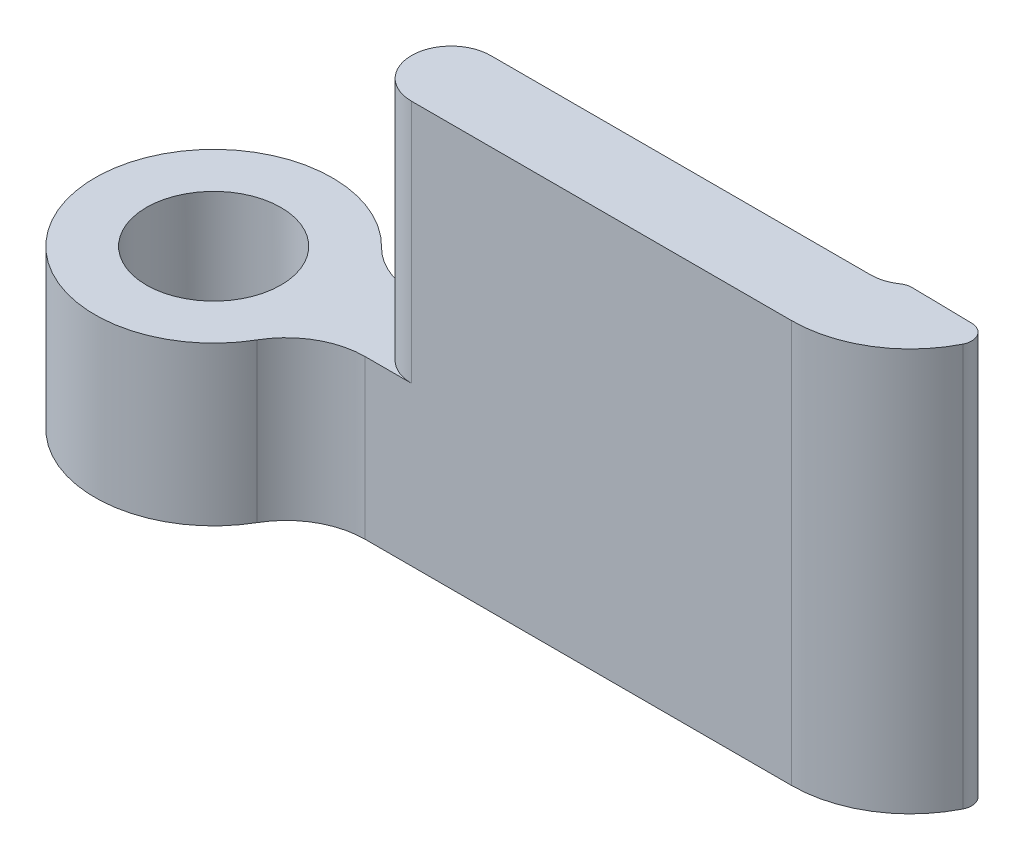
ISO-10303-21;
HEADER;
FILE_DESCRIPTION(('STEP AP214'),'2;1');
FILE_NAME('part.step','',(''),(''),'','','');
FILE_SCHEMA(('AUTOMOTIVE_DESIGN { 1 0 10303 214 1 1 1 1 }'));
ENDSEC;
DATA;
#1=APPLICATION_CONTEXT('core data for automotive mechanical design processes');
#2=APPLICATION_PROTOCOL_DEFINITION('international standard','automotive_design',2000,#1);
#3=PRODUCT_CONTEXT('',#1,'mechanical');
#4=PRODUCT('Part','Part','',(#3));
#5=PRODUCT_RELATED_PRODUCT_CATEGORY('part','',(#4));
#6=PRODUCT_DEFINITION_FORMATION('','',#4);
#7=PRODUCT_DEFINITION_CONTEXT('part definition',#1,'design');
#8=PRODUCT_DEFINITION('design','',#6,#7);
#9=PRODUCT_DEFINITION_SHAPE('','',#8);
#10=(LENGTH_UNIT() NAMED_UNIT(*) SI_UNIT(.MILLI.,.METRE.));
#11=(NAMED_UNIT(*) PLANE_ANGLE_UNIT() SI_UNIT($,.RADIAN.));
#12=(NAMED_UNIT(*) SI_UNIT($,.STERADIAN.) SOLID_ANGLE_UNIT());
#13=UNCERTAINTY_MEASURE_WITH_UNIT(LENGTH_MEASURE(1.E-05),#10,'distance_accuracy_value','');
#14=(GEOMETRIC_REPRESENTATION_CONTEXT(3) GLOBAL_UNCERTAINTY_ASSIGNED_CONTEXT((#13)) GLOBAL_UNIT_ASSIGNED_CONTEXT((#10,
#11,#12)) REPRESENTATION_CONTEXT('',''));
#15=CARTESIAN_POINT('',(0.,0.,0.));
#16=DIRECTION('',(0.,0.,1.));
#17=DIRECTION('',(1.,0.,0.));
#18=AXIS2_PLACEMENT_3D('',#15,#16,#17);
#19=CARTESIAN_POINT('',(19.1841197027665,20.63,-3.175));
#20=DIRECTION('',(0.,-1.,0.));
#21=DIRECTION('',(0.,0.,1.));
#22=AXIS2_PLACEMENT_3D('',#19,#20,#21);
#23=CYLINDRICAL_SURFACE('',#22,3.81);
#24=CARTESIAN_POINT('',(19.1841197027665,3.856199918,-3.175));
#25=DIRECTION('',(0.,1.,0.));
#26=DIRECTION('',(0.,0.,1.));
#27=AXIS2_PLACEMENT_3D('',#24,#25,#26);
#28=CIRCLE('',#27,3.81);
#29=CARTESIAN_POINT('',(19.1841197027665,3.856199918,0.635));
#30=VERTEX_POINT('',#29);
#31=CARTESIAN_POINT('',(22.5865531446849,3.856199918,-1.46048937789378));
#32=VERTEX_POINT('',#31);
#33=EDGE_CURVE('E162',#30,#32,#28,.T.);
#34=ORIENTED_EDGE('',*,*,#33,.T.);
#35=DIRECTION('',(0.,-1.,0.));
#36=VECTOR('',#35,1.);
#37=CARTESIAN_POINT('',(22.5865531446849,20.63,-1.46048937789378));
#38=LINE('',#37,#36);
#39=CARTESIAN_POINT('',(22.5865531446849,16.7786,-1.46048937789378));
#40=VERTEX_POINT('',#39);
#41=EDGE_CURVE('E215',#40,#32,#38,.T.);
#42=ORIENTED_EDGE('',*,*,#41,.F.);
#43=CARTESIAN_POINT('',(19.1841197027665,16.7786,-3.175));
#44=DIRECTION('',(0.,-1.,0.));
#45=DIRECTION('',(0.,0.,-1.));
#46=AXIS2_PLACEMENT_3D('',#43,#44,#45);
#47=CIRCLE('',#46,3.81);
#48=CARTESIAN_POINT('',(19.1841197027665,16.7786,0.635));
#49=VERTEX_POINT('',#48);
#50=EDGE_CURVE('E188',#40,#49,#47,.T.);
#51=ORIENTED_EDGE('',*,*,#50,.T.);
#52=DIRECTION('',(0.,-1.,0.));
#53=VECTOR('',#52,1.);
#54=CARTESIAN_POINT('',(19.1841197027665,20.63,0.635));
#55=LINE('',#54,#53);
#56=EDGE_CURVE('E212',#49,#30,#55,.T.);
#57=ORIENTED_EDGE('',*,*,#56,.T.);
#58=EDGE_LOOP('',(#34,#42,#51,#57));
#59=FACE_BOUND('',#58,.T.);
#60=ADVANCED_FACE('F34',(#59),#23,.T.);
#61=CARTESIAN_POINT('',(5.49926131403118,20.63,0.635));
#62=DIRECTION('',(0.,0.,-1.));
#63=DIRECTION('',(1.,0.,0.));
#64=AXIS2_PLACEMENT_3D('',#61,#62,#63);
#65=PLANE('',#64);
#66=DIRECTION('',(-1.,0.,0.));
#67=VECTOR('',#66,1.);
#68=CARTESIAN_POINT('',(5.49926131403118,8.936199918,0.635));
#69=LINE('',#68,#67);
#70=CARTESIAN_POINT('',(6.985,8.936199918,0.635));
#71=VERTEX_POINT('',#70);
#72=CARTESIAN_POINT('',(5.49926131403118,8.936199918,0.635000000000001));
#73=VERTEX_POINT('',#72);
#74=EDGE_CURVE('E201',#71,#73,#69,.T.);
#75=ORIENTED_EDGE('',*,*,#74,.T.);
#76=DIRECTION('',(0.,-1.,0.));
#77=VECTOR('',#76,1.);
#78=CARTESIAN_POINT('',(5.49926131403118,20.63,0.635));
#79=LINE('',#78,#77);
#80=CARTESIAN_POINT('',(5.49926131403118,3.856199918,0.635000000000001));
#81=VERTEX_POINT('',#80);
#82=EDGE_CURVE('E209',#73,#81,#79,.T.);
#83=ORIENTED_EDGE('',*,*,#82,.T.);
#84=DIRECTION('',(1.,0.,0.));
#85=VECTOR('',#84,1.);
#86=CARTESIAN_POINT('',(5.49926131403118,3.856199918,0.635));
#87=LINE('',#86,#85);
#88=EDGE_CURVE('E160',#81,#30,#87,.T.);
#89=ORIENTED_EDGE('',*,*,#88,.T.);
#90=ORIENTED_EDGE('',*,*,#56,.F.);
#91=DIRECTION('',(-1.,0.,0.));
#92=VECTOR('',#91,1.);
#93=CARTESIAN_POINT('',(5.49926131403118,16.7786,0.635));
#94=LINE('',#93,#92);
#95=CARTESIAN_POINT('',(6.985,16.7786,0.635));
#96=VERTEX_POINT('',#95);
#97=EDGE_CURVE('E185',#49,#96,#94,.T.);
#98=ORIENTED_EDGE('',*,*,#97,.T.);
#99=DIRECTION('',(0.,1.,0.));
#100=VECTOR('',#99,1.);
#101=CARTESIAN_POINT('',(6.985,20.63,0.635));
#102=LINE('',#101,#100);
#103=EDGE_CURVE('E231',#71,#96,#102,.T.);
#104=ORIENTED_EDGE('',*,*,#103,.F.);
#105=EDGE_LOOP('',(#75,#83,#89,#90,#98,#104));
#106=FACE_BOUND('',#105,.T.);
#107=ADVANCED_FACE('F246',(#106),#65,.F.);
#108=CARTESIAN_POINT('',(19.1841197027665,20.63,-1.905));
#109=DIRECTION('',(0.,0.,1.));
#110=DIRECTION('',(-1.,0.,0.));
#111=AXIS2_PLACEMENT_3D('',#108,#109,#110);
#112=PLANE('',#111);
#113=DIRECTION('',(1.,0.,0.));
#114=VECTOR('',#113,1.);
#115=CARTESIAN_POINT('',(19.1841197027665,16.7786,-1.905));
#116=LINE('',#115,#114);
#117=CARTESIAN_POINT('',(6.985,16.7786,-1.905));
#118=VERTEX_POINT('',#117);
#119=CARTESIAN_POINT('',(19.1841197027665,16.7786,-1.905));
#120=VERTEX_POINT('',#119);
#121=EDGE_CURVE('E180',#118,#120,#116,.T.);
#122=ORIENTED_EDGE('',*,*,#121,.T.);
#123=DIRECTION('',(0.,-1.,0.));
#124=VECTOR('',#123,1.);
#125=CARTESIAN_POINT('',(19.1841197027665,20.63,-1.905));
#126=LINE('',#125,#124);
#127=CARTESIAN_POINT('',(19.1841197027665,3.856199918,-1.905));
#128=VERTEX_POINT('',#127);
#129=EDGE_CURVE('E204',#120,#128,#126,.T.);
#130=ORIENTED_EDGE('',*,*,#129,.T.);
#131=DIRECTION('',(-1.,0.,0.));
#132=VECTOR('',#131,1.);
#133=CARTESIAN_POINT('',(19.1841197027665,3.856199918,-1.905));
#134=LINE('',#133,#132);
#135=CARTESIAN_POINT('',(4.53480705212471,3.856199918,-1.905));
#136=VERTEX_POINT('',#135);
#137=EDGE_CURVE('E156',#128,#136,#134,.T.);
#138=ORIENTED_EDGE('',*,*,#137,.T.);
#139=DIRECTION('',(0.,-1.,0.));
#140=VECTOR('',#139,1.);
#141=CARTESIAN_POINT('',(4.53480705212471,20.63,-1.905));
#142=LINE('',#141,#140);
#143=CARTESIAN_POINT('',(4.53480705212471,8.936199918,-1.905));
#144=VERTEX_POINT('',#143);
#145=EDGE_CURVE('E134',#144,#136,#142,.T.);
#146=ORIENTED_EDGE('',*,*,#145,.F.);
#147=DIRECTION('',(1.,0.,0.));
#148=VECTOR('',#147,1.);
#149=CARTESIAN_POINT('',(19.1841197027665,8.936199918,-1.905));
#150=LINE('',#149,#148);
#151=CARTESIAN_POINT('',(6.985,8.936199918,-1.905));
#152=VERTEX_POINT('',#151);
#153=EDGE_CURVE('E192',#144,#152,#150,.T.);
#154=ORIENTED_EDGE('',*,*,#153,.T.);
#155=DIRECTION('',(0.,-1.,0.));
#156=VECTOR('',#155,1.);
#157=CARTESIAN_POINT('',(6.985,20.63,-1.905));
#158=LINE('',#157,#156);
#159=EDGE_CURVE('E240',#118,#152,#158,.T.);
#160=ORIENTED_EDGE('',*,*,#159,.F.);
#161=EDGE_LOOP('',(#122,#130,#138,#146,#154,#160));
#162=FACE_BOUND('',#161,.T.);
#163=ADVANCED_FACE('F268',(#162),#112,.F.);
#164=CARTESIAN_POINT('',(19.1841197027665,20.63,-3.175));
#165=DIRECTION('',(0.,-1.,0.));
#166=DIRECTION('',(0.,0.,1.));
#167=AXIS2_PLACEMENT_3D('',#164,#165,#166);
#168=CYLINDRICAL_SURFACE('',#167,1.27);
#169=CARTESIAN_POINT('',(19.1841197027665,3.856199918,-3.175));
#170=DIRECTION('',(0.,1.,0.));
#171=DIRECTION('',(0.,0.,1.));
#172=AXIS2_PLACEMENT_3D('',#169,#170,#171);
#173=CIRCLE('',#172,1.27);
#174=CARTESIAN_POINT('',(19.9067946493673,3.856199918,-2.13066244846051));
#175=VERTEX_POINT('',#174);
#176=EDGE_CURVE('E170',#175,#128,#173,.F.);
#177=ORIENTED_EDGE('',*,*,#176,.T.);
#178=ORIENTED_EDGE('',*,*,#129,.F.);
#179=CARTESIAN_POINT('',(19.1841197027665,16.7786,-3.175));
#180=DIRECTION('',(0.,-1.,0.));
#181=DIRECTION('',(0.,0.,-1.));
#182=AXIS2_PLACEMENT_3D('',#179,#180,#181);
#183=CIRCLE('',#182,1.27);
#184=CARTESIAN_POINT('',(19.9067946493673,16.7786,-2.13066244846051));
#185=VERTEX_POINT('',#184);
#186=EDGE_CURVE('E177',#120,#185,#183,.F.);
#187=ORIENTED_EDGE('',*,*,#186,.T.);
#188=DIRECTION('',(0.,-1.,0.));
#189=VECTOR('',#188,1.);
#190=CARTESIAN_POINT('',(19.9067946493673,20.63,-2.13066244846051));
#191=LINE('',#190,#189);
#192=EDGE_CURVE('E226',#175,#185,#191,.F.);
#193=ORIENTED_EDGE('',*,*,#192,.F.);
#194=EDGE_LOOP('',(#177,#178,#187,#193));
#195=FACE_BOUND('',#194,.T.);
#196=ADVANCED_FACE('F272',(#195),#168,.F.);
#197=CARTESIAN_POINT('',(22.86,20.63,-2.17299997983507));
#198=DIRECTION('',(-0.0174524064372835,0.,0.999847695156391));
#199=DIRECTION('',(-0.999847695156391,0.,-0.0174524064372835));
#200=AXIS2_PLACEMENT_3D('',#197,#198,#199);
#201=PLANE('',#200);
#202=DIRECTION('',(-0.999847695156391,0.,-0.0174524064372835));
#203=VECTOR('',#202,1.);
#204=CARTESIAN_POINT('',(22.86,3.856199918,-2.17299997983507));
#205=LINE('',#204,#203);
#206=CARTESIAN_POINT('',(22.1487657728487,3.856199918,-2.18541461944917));
#207=VERTEX_POINT('',#206);
#208=CARTESIAN_POINT('',(20.2000385480981,3.856199918,-2.21942977968457));
#209=VERTEX_POINT('',#208);
#210=EDGE_CURVE('E167',#207,#209,#205,.T.);
#211=ORIENTED_EDGE('',*,*,#210,.T.);
#212=DIRECTION('',(0.,-1.,0.));
#213=VECTOR('',#212,1.);
#214=CARTESIAN_POINT('',(20.2000385480981,20.63,-2.21942977968457));
#215=LINE('',#214,#213);
#216=CARTESIAN_POINT('',(20.2000385480981,16.7786,-2.21942977968457));
#217=VERTEX_POINT('',#216);
#218=EDGE_CURVE('E220',#217,#209,#215,.T.);
#219=ORIENTED_EDGE('',*,*,#218,.F.);
#220=DIRECTION('',(0.999847695156391,0.,0.0174524064372835));
#221=VECTOR('',#220,1.);
#222=CARTESIAN_POINT('',(22.86,16.7786,-2.17299997983507));
#223=LINE('',#222,#221);
#224=CARTESIAN_POINT('',(22.1487657728487,16.7786,-2.18541461944917));
#225=VERTEX_POINT('',#224);
#226=EDGE_CURVE('E174',#217,#225,#223,.T.);
#227=ORIENTED_EDGE('',*,*,#226,.T.);
#228=DIRECTION('',(0.,-1.,0.));
#229=VECTOR('',#228,1.);
#230=CARTESIAN_POINT('',(22.1487657728487,20.63,-2.18541461944917));
#231=LINE('',#230,#229);
#232=EDGE_CURVE('E223',#207,#225,#231,.F.);
#233=ORIENTED_EDGE('',*,*,#232,.F.);
#234=EDGE_LOOP('',(#211,#219,#227,#233));
#235=FACE_BOUND('',#234,.T.);
#236=ADVANCED_FACE('F277',(#235),#201,.F.);
#237=CARTESIAN_POINT('',(22.14003956963,20.63,-1.68549077187097));
#238=DIRECTION('',(0.,-1.,0.));
#239=DIRECTION('',(0.,0.,1.));
#240=AXIS2_PLACEMENT_3D('',#237,#238,#239);
#241=CYLINDRICAL_SURFACE('',#240,0.5);
#242=ORIENTED_EDGE('',*,*,#232,.T.);
#243=CARTESIAN_POINT('',(22.14003956963,16.7786,-1.68549077187097));
#244=DIRECTION('',(0.,-1.,0.));
#245=DIRECTION('',(0.,0.,-1.));
#246=AXIS2_PLACEMENT_3D('',#243,#244,#245);
#247=CIRCLE('',#246,0.5);
#248=EDGE_CURVE('E183',#40,#225,#247,.F.);
#249=ORIENTED_EDGE('',*,*,#248,.F.);
#250=ORIENTED_EDGE('',*,*,#41,.T.);
#251=CARTESIAN_POINT('',(22.14003956963,3.856199918,-1.68549077187097));
#252=DIRECTION('',(0.,1.,0.));
#253=DIRECTION('',(0.,0.,1.));
#254=AXIS2_PLACEMENT_3D('',#251,#252,#253);
#255=CIRCLE('',#254,0.5);
#256=EDGE_CURVE('E165',#207,#32,#255,.F.);
#257=ORIENTED_EDGE('',*,*,#256,.F.);
#258=EDGE_LOOP('',(#242,#249,#250,#257));
#259=FACE_BOUND('',#258,.T.);
#260=ADVANCED_FACE('F259',(#259),#241,.T.);
#261=CARTESIAN_POINT('',(20.1913123448794,20.63,-1.71950593210638));
#262=DIRECTION('',(0.,-1.,0.));
#263=DIRECTION('',(0.,0.,1.));
#264=AXIS2_PLACEMENT_3D('',#261,#262,#263);
#265=CYLINDRICAL_SURFACE('',#264,0.5);
#266=ORIENTED_EDGE('',*,*,#192,.T.);
#267=CARTESIAN_POINT('',(20.1913123448794,16.7786,-1.71950593210638));
#268=DIRECTION('',(0.,-1.,0.));
#269=DIRECTION('',(0.,0.,-1.));
#270=AXIS2_PLACEMENT_3D('',#267,#268,#269);
#271=CIRCLE('',#270,0.5);
#272=EDGE_CURVE('E229',#217,#185,#271,.F.);
#273=ORIENTED_EDGE('',*,*,#272,.F.);
#274=ORIENTED_EDGE('',*,*,#218,.T.);
#275=CARTESIAN_POINT('',(20.1913123448794,3.856199918,-1.71950593210638));
#276=DIRECTION('',(0.,1.,0.));
#277=DIRECTION('',(0.,0.,1.));
#278=AXIS2_PLACEMENT_3D('',#275,#276,#277);
#279=CIRCLE('',#278,0.5);
#280=EDGE_CURVE('E172',#175,#209,#279,.F.);
#281=ORIENTED_EDGE('',*,*,#280,.F.);
#282=EDGE_LOOP('',(#266,#273,#274,#281));
#283=FACE_BOUND('',#282,.T.);
#284=ADVANCED_FACE('F274',(#283),#265,.T.);
#285=CARTESIAN_POINT('',(5.49926131403118,20.63,3.175));
#286=DIRECTION('',(0.,-1.,0.));
#287=DIRECTION('',(0.,0.,1.));
#288=AXIS2_PLACEMENT_3D('',#285,#286,#287);
#289=CYLINDRICAL_SURFACE('',#288,2.54);
#290=CARTESIAN_POINT('',(5.49926131403118,3.856199918,3.175));
#291=DIRECTION('',(0.,1.,0.));
#292=DIRECTION('',(0.,0.,1.));
#293=AXIS2_PLACEMENT_3D('',#290,#291,#292);
#294=CIRCLE('',#293,2.54);
#295=CARTESIAN_POINT('',(3.29955678841871,3.856199918,1.905));
#296=VERTEX_POINT('',#295);
#297=EDGE_CURVE('E154',#296,#81,#294,.F.);
#298=ORIENTED_EDGE('',*,*,#297,.T.);
#299=ORIENTED_EDGE('',*,*,#82,.F.);
#300=CARTESIAN_POINT('',(5.49926131403118,8.936199918,3.175));
#301=DIRECTION('',(0.,-1.,0.));
#302=DIRECTION('',(0.,0.,-1.));
#303=AXIS2_PLACEMENT_3D('',#300,#301,#302);
#304=CIRCLE('',#303,2.54);
#305=CARTESIAN_POINT('',(3.29955678841871,8.936199918,1.905));
#306=VERTEX_POINT('',#305);
#307=EDGE_CURVE('E198',#73,#306,#304,.F.);
#308=ORIENTED_EDGE('',*,*,#307,.T.);
#309=DIRECTION('',(0.,-1.,0.));
#310=VECTOR('',#309,1.);
#311=CARTESIAN_POINT('',(3.29955678841871,20.63,1.905));
#312=LINE('',#311,#310);
#313=EDGE_CURVE('E147',#306,#296,#312,.T.);
#314=ORIENTED_EDGE('',*,*,#313,.T.);
#315=EDGE_LOOP('',(#298,#299,#308,#314));
#316=FACE_BOUND('',#315,.T.);
#317=ADVANCED_FACE('F251',(#316),#289,.F.);
#318=CARTESIAN_POINT('',(0.,20.63,0.));
#319=DIRECTION('',(0.,-1.,0.));
#320=DIRECTION('',(0.,0.,1.));
#321=AXIS2_PLACEMENT_3D('',#318,#319,#320);
#322=CYLINDRICAL_SURFACE('',#321,3.80999999999999);
#323=CARTESIAN_POINT('',(0.,3.856199918,0.));
#324=DIRECTION('',(0.,1.,0.));
#325=DIRECTION('',(0.,0.,1.));
#326=AXIS2_PLACEMENT_3D('',#323,#324,#325);
#327=CIRCLE('',#326,3.80999999999999);
#328=CARTESIAN_POINT('',(2.72088423127483,3.856199918,-2.667));
#329=VERTEX_POINT('',#328);
#330=EDGE_CURVE('E139',#329,#296,#327,.T.);
#331=ORIENTED_EDGE('',*,*,#330,.T.);
#332=ORIENTED_EDGE('',*,*,#313,.F.);
#333=CARTESIAN_POINT('',(0.,8.936199918,0.));
#334=DIRECTION('',(0.,-1.,0.));
#335=DIRECTION('',(0.,0.,-1.));
#336=AXIS2_PLACEMENT_3D('',#333,#334,#335);
#337=CIRCLE('',#336,3.80999999999999);
#338=CARTESIAN_POINT('',(2.72088423127483,8.936199918,-2.667));
#339=VERTEX_POINT('',#338);
#340=EDGE_CURVE('E146',#306,#339,#337,.T.);
#341=ORIENTED_EDGE('',*,*,#340,.T.);
#342=DIRECTION('',(0.,-1.,0.));
#343=VECTOR('',#342,1.);
#344=CARTESIAN_POINT('',(2.72088423127483,20.63,-2.667));
#345=LINE('',#344,#343);
#346=EDGE_CURVE('E131',#339,#329,#345,.T.);
#347=ORIENTED_EDGE('',*,*,#346,.T.);
#348=EDGE_LOOP('',(#331,#332,#341,#347));
#349=FACE_BOUND('',#348,.T.);
#350=ADVANCED_FACE('F143',(#349),#322,.T.);
#351=CARTESIAN_POINT('',(4.53480705212471,20.63,-4.445));
#352=DIRECTION('',(0.,-1.,0.));
#353=DIRECTION('',(0.,0.,1.));
#354=AXIS2_PLACEMENT_3D('',#351,#352,#353);
#355=CYLINDRICAL_SURFACE('',#354,2.54);
#356=CARTESIAN_POINT('',(4.53480705212471,3.856199918,-4.445));
#357=DIRECTION('',(0.,1.,0.));
#358=DIRECTION('',(0.,0.,1.));
#359=AXIS2_PLACEMENT_3D('',#356,#357,#358);
#360=CIRCLE('',#359,2.54);
#361=EDGE_CURVE('E128',#136,#329,#360,.F.);
#362=ORIENTED_EDGE('',*,*,#361,.T.);
#363=ORIENTED_EDGE('',*,*,#346,.F.);
#364=CARTESIAN_POINT('',(4.53480705212471,8.936199918,-4.445));
#365=DIRECTION('',(0.,-1.,0.));
#366=DIRECTION('',(0.,0.,-1.));
#367=AXIS2_PLACEMENT_3D('',#364,#365,#366);
#368=CIRCLE('',#367,2.54);
#369=EDGE_CURVE('E195',#339,#144,#368,.F.);
#370=ORIENTED_EDGE('',*,*,#369,.T.);
#371=ORIENTED_EDGE('',*,*,#145,.T.);
#372=EDGE_LOOP('',(#362,#363,#370,#371));
#373=FACE_BOUND('',#372,.T.);
#374=ADVANCED_FACE('F130',(#373),#355,.F.);
#375=CARTESIAN_POINT('',(0.,20.63,0.));
#376=DIRECTION('',(0.,-1.,0.));
#377=DIRECTION('',(0.,0.,1.));
#378=AXIS2_PLACEMENT_3D('',#375,#376,#377);
#379=CYLINDRICAL_SURFACE('',#378,2.159);
#380=CARTESIAN_POINT('',(0.,8.936199918,0.));
#381=DIRECTION('',(0.,-1.,0.));
#382=DIRECTION('',(0.,0.,-1.));
#383=AXIS2_PLACEMENT_3D('',#380,#381,#382);
#384=CIRCLE('',#383,2.159);
#385=CARTESIAN_POINT('',(0.,8.936199918,-2.15900000000001));
#386=VERTEX_POINT('',#385);
#387=EDGE_CURVE('E191',#386,#386,#384,.T.);
#388=ORIENTED_EDGE('',*,*,#387,.F.);
#389=EDGE_LOOP('',(#388));
#390=FACE_BOUND('',#389,.T.);
#391=CARTESIAN_POINT('',(0.,3.856199918,0.));
#392=DIRECTION('',(0.,1.,0.));
#393=DIRECTION('',(0.,0.,1.));
#394=AXIS2_PLACEMENT_3D('',#391,#392,#393);
#395=CIRCLE('',#394,2.159);
#396=CARTESIAN_POINT('',(0.,3.856199918,2.15899999999999));
#397=VERTEX_POINT('',#396);
#398=EDGE_CURVE('E140',#397,#397,#395,.T.);
#399=ORIENTED_EDGE('',*,*,#398,.F.);
#400=EDGE_LOOP('',(#399));
#401=FACE_BOUND('',#400,.T.);
#402=ADVANCED_FACE('F310',(#390,#401),#379,.F.);
#403=CARTESIAN_POINT('',(0.,8.936199918,0.));
#404=DIRECTION('',(0.,1.,0.));
#405=DIRECTION('',(0.,0.,-1.));
#406=AXIS2_PLACEMENT_3D('',#403,#404,#405);
#407=PLANE('',#406);
#408=ORIENTED_EDGE('',*,*,#387,.T.);
#409=EDGE_LOOP('',(#408));
#410=FACE_BOUND('',#409,.T.);
#411=ORIENTED_EDGE('',*,*,#74,.F.);
#412=CARTESIAN_POINT('',(6.985,8.936199918,-0.635));
#413=DIRECTION('',(0.,-1.,0.));
#414=DIRECTION('',(0.,0.,-1.));
#415=AXIS2_PLACEMENT_3D('',#412,#413,#414);
#416=CIRCLE('',#415,1.27);
#417=CARTESIAN_POINT('',(5.715,8.936199918,-0.635));
#418=VERTEX_POINT('',#417);
#419=EDGE_CURVE('E43',#418,#71,#416,.F.);
#420=ORIENTED_EDGE('',*,*,#419,.F.);
#421=CARTESIAN_POINT('',(6.985,8.936199918,-0.635));
#422=DIRECTION('',(0.,-1.,0.));
#423=DIRECTION('',(0.,0.,-1.));
#424=AXIS2_PLACEMENT_3D('',#421,#422,#423);
#425=CIRCLE('',#424,1.27);
#426=EDGE_CURVE('E12',#152,#418,#425,.F.);
#427=ORIENTED_EDGE('',*,*,#426,.F.);
#428=ORIENTED_EDGE('',*,*,#153,.F.);
#429=ORIENTED_EDGE('',*,*,#369,.F.);
#430=ORIENTED_EDGE('',*,*,#340,.F.);
#431=ORIENTED_EDGE('',*,*,#307,.F.);
#432=EDGE_LOOP('',(#411,#420,#427,#428,#429,#430,#431));
#433=FACE_BOUND('',#432,.T.);
#434=ADVANCED_FACE('F248',(#410,#433),#407,.T.);
#435=CARTESIAN_POINT('',(0.,16.7786,0.));
#436=DIRECTION('',(0.,1.,0.));
#437=DIRECTION('',(0.,0.,-1.));
#438=AXIS2_PLACEMENT_3D('',#435,#436,#437);
#439=PLANE('',#438);
#440=ORIENTED_EDGE('',*,*,#97,.F.);
#441=ORIENTED_EDGE('',*,*,#50,.F.);
#442=ORIENTED_EDGE('',*,*,#248,.T.);
#443=ORIENTED_EDGE('',*,*,#226,.F.);
#444=ORIENTED_EDGE('',*,*,#272,.T.);
#445=ORIENTED_EDGE('',*,*,#186,.F.);
#446=ORIENTED_EDGE('',*,*,#121,.F.);
#447=CARTESIAN_POINT('',(6.985,16.7786,-0.635));
#448=DIRECTION('',(0.,-1.,0.));
#449=DIRECTION('',(0.,0.,-1.));
#450=AXIS2_PLACEMENT_3D('',#447,#448,#449);
#451=CIRCLE('',#450,1.27);
#452=CARTESIAN_POINT('',(5.715,16.7786,-0.635));
#453=VERTEX_POINT('',#452);
#454=EDGE_CURVE('E236',#453,#118,#451,.T.);
#455=ORIENTED_EDGE('',*,*,#454,.F.);
#456=CARTESIAN_POINT('',(6.985,16.7786,-0.635));
#457=DIRECTION('',(0.,-1.,0.));
#458=DIRECTION('',(0.,0.,-1.));
#459=AXIS2_PLACEMENT_3D('',#456,#457,#458);
#460=CIRCLE('',#459,1.27);
#461=EDGE_CURVE('E238',#96,#453,#460,.T.);
#462=ORIENTED_EDGE('',*,*,#461,.F.);
#463=EDGE_LOOP('',(#440,#441,#442,#443,#444,#445,#446,#455,#462));
#464=FACE_BOUND('',#463,.T.);
#465=ADVANCED_FACE('F262',(#464),#439,.T.);
#466=CARTESIAN_POINT('',(0.,3.856199918,0.));
#467=DIRECTION('',(0.,-1.,0.));
#468=DIRECTION('',(0.,0.,1.));
#469=AXIS2_PLACEMENT_3D('',#466,#467,#468);
#470=PLANE('',#469);
#471=ORIENTED_EDGE('',*,*,#176,.F.);
#472=ORIENTED_EDGE('',*,*,#280,.T.);
#473=ORIENTED_EDGE('',*,*,#210,.F.);
#474=ORIENTED_EDGE('',*,*,#256,.T.);
#475=ORIENTED_EDGE('',*,*,#33,.F.);
#476=ORIENTED_EDGE('',*,*,#88,.F.);
#477=ORIENTED_EDGE('',*,*,#297,.F.);
#478=ORIENTED_EDGE('',*,*,#330,.F.);
#479=ORIENTED_EDGE('',*,*,#361,.F.);
#480=ORIENTED_EDGE('',*,*,#137,.F.);
#481=EDGE_LOOP('',(#471,#472,#473,#474,#475,#476,#477,#478,#479,#480));
#482=FACE_BOUND('',#481,.T.);
#483=ORIENTED_EDGE('',*,*,#398,.T.);
#484=EDGE_LOOP('',(#483));
#485=FACE_BOUND('',#484,.T.);
#486=ADVANCED_FACE('F151',(#482,#485),#470,.T.);
#487=CARTESIAN_POINT('',(6.985,20.63,-0.635));
#488=DIRECTION('',(0.,-1.,0.));
#489=DIRECTION('',(0.,0.,1.));
#490=AXIS2_PLACEMENT_3D('',#487,#488,#489);
#491=CYLINDRICAL_SURFACE('',#490,1.27);
#492=DIRECTION('',(0.,-1.,0.));
#493=VECTOR('',#492,1.);
#494=CARTESIAN_POINT('',(5.715,8.936199918,-0.635));
#495=LINE('',#494,#493);
#496=EDGE_CURVE('E38',#418,#453,#495,.F.);
#497=ORIENTED_EDGE('',*,*,#496,.T.);
#498=ORIENTED_EDGE('',*,*,#454,.T.);
#499=ORIENTED_EDGE('',*,*,#159,.T.);
#500=ORIENTED_EDGE('',*,*,#426,.T.);
#501=EDGE_LOOP('',(#497,#498,#499,#500));
#502=FACE_BOUND('',#501,.T.);
#503=ADVANCED_FACE('F36',(#502),#491,.T.);
#504=CARTESIAN_POINT('',(6.985,20.63,-0.635));
#505=DIRECTION('',(0.,1.,0.));
#506=DIRECTION('',(0.,0.,-1.));
#507=AXIS2_PLACEMENT_3D('',#504,#505,#506);
#508=CYLINDRICAL_SURFACE('',#507,1.27);
#509=ORIENTED_EDGE('',*,*,#419,.T.);
#510=ORIENTED_EDGE('',*,*,#103,.T.);
#511=ORIENTED_EDGE('',*,*,#461,.T.);
#512=ORIENTED_EDGE('',*,*,#496,.F.);
#513=EDGE_LOOP('',(#509,#510,#511,#512));
#514=FACE_BOUND('',#513,.T.);
#515=ADVANCED_FACE('F243',(#514),#508,.T.);
#516=CLOSED_SHELL('',(#60,#107,#163,#196,#236,#260,#284,#317,#350,#374,#402,#434,#465,#486,#503,#515));
#517=MANIFOLD_SOLID_BREP('B2',#516);
#518=ADVANCED_BREP_SHAPE_REPRESENTATION('',(#18,#517),#14);
#519=SHAPE_DEFINITION_REPRESENTATION(#9,#518);
ENDSEC;
END-ISO-10303-21;
